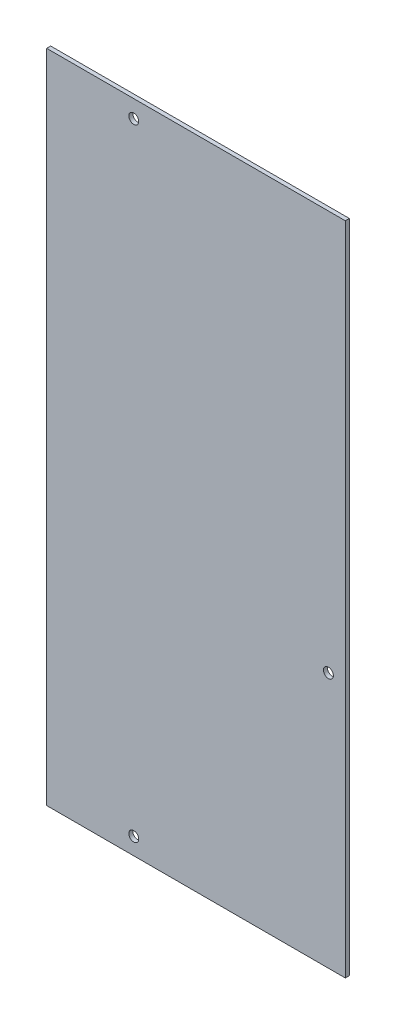
ISO-10303-21;
HEADER;
FILE_DESCRIPTION(('STEP AP214'),'2;1');
FILE_NAME('part.step','',(''),(''),'','','');
FILE_SCHEMA(('AUTOMOTIVE_DESIGN { 1 0 10303 214 1 1 1 1 }'));
ENDSEC;
DATA;
#1=APPLICATION_CONTEXT('core data for automotive mechanical design processes');
#2=APPLICATION_PROTOCOL_DEFINITION('international standard','automotive_design',2000,#1);
#3=PRODUCT_CONTEXT('',#1,'mechanical');
#4=PRODUCT('Part','Part','',(#3));
#5=PRODUCT_RELATED_PRODUCT_CATEGORY('part','',(#4));
#6=PRODUCT_DEFINITION_FORMATION('','',#4);
#7=PRODUCT_DEFINITION_CONTEXT('part definition',#1,'design');
#8=PRODUCT_DEFINITION('design','',#6,#7);
#9=PRODUCT_DEFINITION_SHAPE('','',#8);
#10=(LENGTH_UNIT() NAMED_UNIT(*) SI_UNIT(.MILLI.,.METRE.));
#11=(NAMED_UNIT(*) PLANE_ANGLE_UNIT() SI_UNIT($,.RADIAN.));
#12=(NAMED_UNIT(*) SI_UNIT($,.STERADIAN.) SOLID_ANGLE_UNIT());
#13=UNCERTAINTY_MEASURE_WITH_UNIT(LENGTH_MEASURE(1.E-05),#10,'distance_accuracy_value','');
#14=(GEOMETRIC_REPRESENTATION_CONTEXT(3) GLOBAL_UNCERTAINTY_ASSIGNED_CONTEXT((#13)) GLOBAL_UNIT_ASSIGNED_CONTEXT((#10,
#11,#12)) REPRESENTATION_CONTEXT('',''));
#15=CARTESIAN_POINT('',(0.,0.,0.));
#16=DIRECTION('',(0.,0.,1.));
#17=DIRECTION('',(1.,0.,0.));
#18=AXIS2_PLACEMENT_3D('',#15,#16,#17);
#19=CARTESIAN_POINT('',(114.4905,251.3838,3.0734));
#20=DIRECTION('',(-1.,0.,0.));
#21=DIRECTION('',(0.,-1.,0.));
#22=AXIS2_PLACEMENT_3D('',#19,#20,#21);
#23=PLANE('',#22);
#24=DIRECTION('',(0.,1.,0.));
#25=VECTOR('',#24,1.);
#26=CARTESIAN_POINT('',(114.4905,251.3838,0.));
#27=LINE('',#26,#25);
#28=CARTESIAN_POINT('',(114.4905,-251.3838,0.));
#29=VERTEX_POINT('',#28);
#30=CARTESIAN_POINT('',(114.4905,251.3838,0.));
#31=VERTEX_POINT('',#30);
#32=EDGE_CURVE('E96',#29,#31,#27,.T.);
#33=ORIENTED_EDGE('',*,*,#32,.T.);
#34=DIRECTION('',(0.,0.,-1.));
#35=VECTOR('',#34,1.);
#36=CARTESIAN_POINT('',(114.4905,251.3838,3.0734));
#37=LINE('',#36,#35);
#38=CARTESIAN_POINT('',(114.4905,251.3838,3.0734));
#39=VERTEX_POINT('',#38);
#40=EDGE_CURVE('E11',#39,#31,#37,.T.);
#41=ORIENTED_EDGE('',*,*,#40,.F.);
#42=DIRECTION('',(0.,1.,0.));
#43=VECTOR('',#42,1.);
#44=CARTESIAN_POINT('',(114.4905,251.3838,3.0734));
#45=LINE('',#44,#43);
#46=CARTESIAN_POINT('',(114.4905,-251.3838,3.0734));
#47=VERTEX_POINT('',#46);
#48=EDGE_CURVE('E84',#47,#39,#45,.T.);
#49=ORIENTED_EDGE('',*,*,#48,.F.);
#50=DIRECTION('',(0.,0.,-1.));
#51=VECTOR('',#50,1.);
#52=CARTESIAN_POINT('',(114.4905,-251.3838,3.0734));
#53=LINE('',#52,#51);
#54=EDGE_CURVE('E92',#47,#29,#53,.T.);
#55=ORIENTED_EDGE('',*,*,#54,.T.);
#56=EDGE_LOOP('',(#33,#41,#49,#55));
#57=FACE_BOUND('',#56,.T.);
#58=ADVANCED_FACE('F33',(#57),#23,.F.);
#59=CARTESIAN_POINT('',(-114.4905,251.3838,3.0734));
#60=DIRECTION('',(0.,-1.,0.));
#61=DIRECTION('',(0.,0.,-1.));
#62=AXIS2_PLACEMENT_3D('',#59,#60,#61);
#63=PLANE('',#62);
#64=DIRECTION('',(-1.,0.,0.));
#65=VECTOR('',#64,1.);
#66=CARTESIAN_POINT('',(-114.4905,251.3838,0.));
#67=LINE('',#66,#65);
#68=CARTESIAN_POINT('',(-114.4905,251.3838,0.));
#69=VERTEX_POINT('',#68);
#70=EDGE_CURVE('E88',#31,#69,#67,.T.);
#71=ORIENTED_EDGE('',*,*,#70,.T.);
#72=DIRECTION('',(0.,0.,-1.));
#73=VECTOR('',#72,1.);
#74=CARTESIAN_POINT('',(-114.4905,251.3838,3.0734));
#75=LINE('',#74,#73);
#76=CARTESIAN_POINT('',(-114.4905,251.3838,3.0734));
#77=VERTEX_POINT('',#76);
#78=EDGE_CURVE('E41',#77,#69,#75,.T.);
#79=ORIENTED_EDGE('',*,*,#78,.F.);
#80=DIRECTION('',(-1.,0.,0.));
#81=VECTOR('',#80,1.);
#82=CARTESIAN_POINT('',(-114.4905,251.3838,3.0734));
#83=LINE('',#82,#81);
#84=EDGE_CURVE('E79',#39,#77,#83,.T.);
#85=ORIENTED_EDGE('',*,*,#84,.F.);
#86=ORIENTED_EDGE('',*,*,#40,.T.);
#87=EDGE_LOOP('',(#71,#79,#85,#86));
#88=FACE_BOUND('',#87,.T.);
#89=ADVANCED_FACE('F87',(#88),#63,.F.);
#90=CARTESIAN_POINT('',(-114.4905,251.3838,3.0734));
#91=DIRECTION('',(1.,0.,0.));
#92=DIRECTION('',(0.,1.,0.));
#93=AXIS2_PLACEMENT_3D('',#90,#91,#92);
#94=PLANE('',#93);
#95=DIRECTION('',(0.,-1.,0.));
#96=VECTOR('',#95,1.);
#97=CARTESIAN_POINT('',(-114.4905,251.3838,0.));
#98=LINE('',#97,#96);
#99=CARTESIAN_POINT('',(-114.4905,-251.3838,0.));
#100=VERTEX_POINT('',#99);
#101=EDGE_CURVE('E66',#69,#100,#98,.T.);
#102=ORIENTED_EDGE('',*,*,#101,.T.);
#103=DIRECTION('',(0.,0.,-1.));
#104=VECTOR('',#103,1.);
#105=CARTESIAN_POINT('',(-114.4905,-251.3838,3.0734));
#106=LINE('',#105,#104);
#107=CARTESIAN_POINT('',(-114.4905,-251.3838,3.0734));
#108=VERTEX_POINT('',#107);
#109=EDGE_CURVE('E89',#108,#100,#106,.T.);
#110=ORIENTED_EDGE('',*,*,#109,.F.);
#111=DIRECTION('',(0.,-1.,0.));
#112=VECTOR('',#111,1.);
#113=CARTESIAN_POINT('',(-114.4905,251.3838,3.0734));
#114=LINE('',#113,#112);
#115=EDGE_CURVE('E82',#77,#108,#114,.T.);
#116=ORIENTED_EDGE('',*,*,#115,.F.);
#117=ORIENTED_EDGE('',*,*,#78,.T.);
#118=EDGE_LOOP('',(#102,#110,#116,#117));
#119=FACE_BOUND('',#118,.T.);
#120=ADVANCED_FACE('F90',(#119),#94,.F.);
#121=CARTESIAN_POINT('',(-114.4905,-251.3838,3.0734));
#122=DIRECTION('',(0.,1.,0.));
#123=DIRECTION('',(0.,0.,1.));
#124=AXIS2_PLACEMENT_3D('',#121,#122,#123);
#125=PLANE('',#124);
#126=DIRECTION('',(1.,0.,0.));
#127=VECTOR('',#126,1.);
#128=CARTESIAN_POINT('',(-114.4905,-251.3838,0.));
#129=LINE('',#128,#127);
#130=EDGE_CURVE('E72',#100,#29,#129,.T.);
#131=ORIENTED_EDGE('',*,*,#130,.T.);
#132=ORIENTED_EDGE('',*,*,#54,.F.);
#133=DIRECTION('',(1.,0.,0.));
#134=VECTOR('',#133,1.);
#135=CARTESIAN_POINT('',(-114.4905,-251.3838,3.0734));
#136=LINE('',#135,#134);
#137=EDGE_CURVE('E49',#108,#47,#136,.T.);
#138=ORIENTED_EDGE('',*,*,#137,.F.);
#139=ORIENTED_EDGE('',*,*,#109,.T.);
#140=EDGE_LOOP('',(#131,#132,#138,#139));
#141=FACE_BOUND('',#140,.T.);
#142=ADVANCED_FACE('F104',(#141),#125,.F.);
#143=CARTESIAN_POINT('',(0.,0.,3.0734));
#144=DIRECTION('',(0.,0.,1.));
#145=DIRECTION('',(1.,0.,0.));
#146=AXIS2_PLACEMENT_3D('',#143,#144,#145);
#147=PLANE('',#146);
#148=CARTESIAN_POINT('',(-47.7139,-238.4044,3.0734));
#149=DIRECTION('',(0.,0.,1.));
#150=DIRECTION('',(1.,0.,0.));
#151=AXIS2_PLACEMENT_3D('',#148,#149,#150);
#152=CIRCLE('',#151,3.81);
#153=CARTESIAN_POINT('',(-43.9039,-238.4044,3.0734));
#154=VERTEX_POINT('',#153);
#155=EDGE_CURVE('E122',#154,#154,#152,.T.);
#156=ORIENTED_EDGE('',*,*,#155,.F.);
#157=EDGE_LOOP('',(#156));
#158=FACE_BOUND('',#157,.T.);
#159=CARTESIAN_POINT('',(101.5111,-55.2788666666667,3.0734));
#160=DIRECTION('',(0.,0.,1.));
#161=DIRECTION('',(1.,0.,0.));
#162=AXIS2_PLACEMENT_3D('',#159,#160,#161);
#163=CIRCLE('',#162,3.81);
#164=CARTESIAN_POINT('',(105.3211,-55.2788666666667,3.0734));
#165=VERTEX_POINT('',#164);
#166=EDGE_CURVE('E116',#165,#165,#163,.T.);
#167=ORIENTED_EDGE('',*,*,#166,.F.);
#168=EDGE_LOOP('',(#167));
#169=FACE_BOUND('',#168,.T.);
#170=CARTESIAN_POINT('',(-47.7139,238.0488,3.0734));
#171=DIRECTION('',(0.,0.,1.));
#172=DIRECTION('',(1.,0.,0.));
#173=AXIS2_PLACEMENT_3D('',#170,#171,#172);
#174=CIRCLE('',#173,3.81);
#175=CARTESIAN_POINT('',(-43.9039,238.0488,3.0734));
#176=VERTEX_POINT('',#175);
#177=EDGE_CURVE('E110',#176,#176,#174,.T.);
#178=ORIENTED_EDGE('',*,*,#177,.F.);
#179=EDGE_LOOP('',(#178));
#180=FACE_BOUND('',#179,.T.);
#181=ORIENTED_EDGE('',*,*,#48,.T.);
#182=ORIENTED_EDGE('',*,*,#84,.T.);
#183=ORIENTED_EDGE('',*,*,#115,.T.);
#184=ORIENTED_EDGE('',*,*,#137,.T.);
#185=EDGE_LOOP('',(#181,#182,#183,#184));
#186=FACE_BOUND('',#185,.T.);
#187=ADVANCED_FACE('F80',(#158,#169,#180,#186),#147,.T.);
#188=CARTESIAN_POINT('',(0.,0.,0.));
#189=DIRECTION('',(0.,0.,1.));
#190=DIRECTION('',(1.,0.,0.));
#191=AXIS2_PLACEMENT_3D('',#188,#189,#190);
#192=PLANE('',#191);
#193=CARTESIAN_POINT('',(-47.7139,-238.4044,0.));
#194=DIRECTION('',(0.,0.,1.));
#195=DIRECTION('',(1.,0.,0.));
#196=AXIS2_PLACEMENT_3D('',#193,#194,#195);
#197=CIRCLE('',#196,3.81);
#198=CARTESIAN_POINT('',(-43.9039,-238.4044,0.));
#199=VERTEX_POINT('',#198);
#200=EDGE_CURVE('E113',#199,#199,#197,.T.);
#201=ORIENTED_EDGE('',*,*,#200,.T.);
#202=EDGE_LOOP('',(#201));
#203=FACE_BOUND('',#202,.T.);
#204=CARTESIAN_POINT('',(101.5111,-55.2788666666667,0.));
#205=DIRECTION('',(0.,0.,1.));
#206=DIRECTION('',(1.,0.,0.));
#207=AXIS2_PLACEMENT_3D('',#204,#205,#206);
#208=CIRCLE('',#207,3.81);
#209=CARTESIAN_POINT('',(105.3211,-55.2788666666667,0.));
#210=VERTEX_POINT('',#209);
#211=EDGE_CURVE('E119',#210,#210,#208,.T.);
#212=ORIENTED_EDGE('',*,*,#211,.T.);
#213=EDGE_LOOP('',(#212));
#214=FACE_BOUND('',#213,.T.);
#215=CARTESIAN_POINT('',(-47.7139,238.0488,0.));
#216=DIRECTION('',(0.,0.,1.));
#217=DIRECTION('',(1.,0.,0.));
#218=AXIS2_PLACEMENT_3D('',#215,#216,#217);
#219=CIRCLE('',#218,3.81);
#220=CARTESIAN_POINT('',(-43.9039,238.0488,0.));
#221=VERTEX_POINT('',#220);
#222=EDGE_CURVE('E99',#221,#221,#219,.T.);
#223=ORIENTED_EDGE('',*,*,#222,.T.);
#224=EDGE_LOOP('',(#223));
#225=FACE_BOUND('',#224,.T.);
#226=ORIENTED_EDGE('',*,*,#32,.F.);
#227=ORIENTED_EDGE('',*,*,#130,.F.);
#228=ORIENTED_EDGE('',*,*,#101,.F.);
#229=ORIENTED_EDGE('',*,*,#70,.F.);
#230=EDGE_LOOP('',(#226,#227,#228,#229));
#231=FACE_BOUND('',#230,.T.);
#232=ADVANCED_FACE('F107',(#203,#214,#225,#231),#192,.F.);
#233=CARTESIAN_POINT('',(-47.7139,238.0488,0.));
#234=DIRECTION('',(0.,0.,1.));
#235=DIRECTION('',(1.,0.,0.));
#236=AXIS2_PLACEMENT_3D('',#233,#234,#235);
#237=CYLINDRICAL_SURFACE('',#236,3.81);
#238=ORIENTED_EDGE('',*,*,#222,.F.);
#239=EDGE_LOOP('',(#238));
#240=FACE_BOUND('',#239,.T.);
#241=ORIENTED_EDGE('',*,*,#177,.T.);
#242=EDGE_LOOP('',(#241));
#243=FACE_BOUND('',#242,.T.);
#244=ADVANCED_FACE('F144',(#240,#243),#237,.F.);
#245=CARTESIAN_POINT('',(101.5111,-55.2788666666667,0.));
#246=DIRECTION('',(0.,0.,1.));
#247=DIRECTION('',(1.,0.,0.));
#248=AXIS2_PLACEMENT_3D('',#245,#246,#247);
#249=CYLINDRICAL_SURFACE('',#248,3.81);
#250=ORIENTED_EDGE('',*,*,#211,.F.);
#251=EDGE_LOOP('',(#250));
#252=FACE_BOUND('',#251,.T.);
#253=ORIENTED_EDGE('',*,*,#166,.T.);
#254=EDGE_LOOP('',(#253));
#255=FACE_BOUND('',#254,.T.);
#256=ADVANCED_FACE('F133',(#252,#255),#249,.F.);
#257=CARTESIAN_POINT('',(-47.7139,-238.4044,0.));
#258=DIRECTION('',(0.,0.,1.));
#259=DIRECTION('',(1.,0.,0.));
#260=AXIS2_PLACEMENT_3D('',#257,#258,#259);
#261=CYLINDRICAL_SURFACE('',#260,3.81);
#262=ORIENTED_EDGE('',*,*,#200,.F.);
#263=EDGE_LOOP('',(#262));
#264=FACE_BOUND('',#263,.T.);
#265=ORIENTED_EDGE('',*,*,#155,.T.);
#266=EDGE_LOOP('',(#265));
#267=FACE_BOUND('',#266,.T.);
#268=ADVANCED_FACE('F130',(#264,#267),#261,.F.);
#269=CLOSED_SHELL('',(#58,#89,#120,#142,#187,#232,#244,#256,#268));
#270=MANIFOLD_SOLID_BREP('B2',#269);
#271=ADVANCED_BREP_SHAPE_REPRESENTATION('',(#18,#270),#14);
#272=SHAPE_DEFINITION_REPRESENTATION(#9,#271);
ENDSEC;
END-ISO-10303-21;
